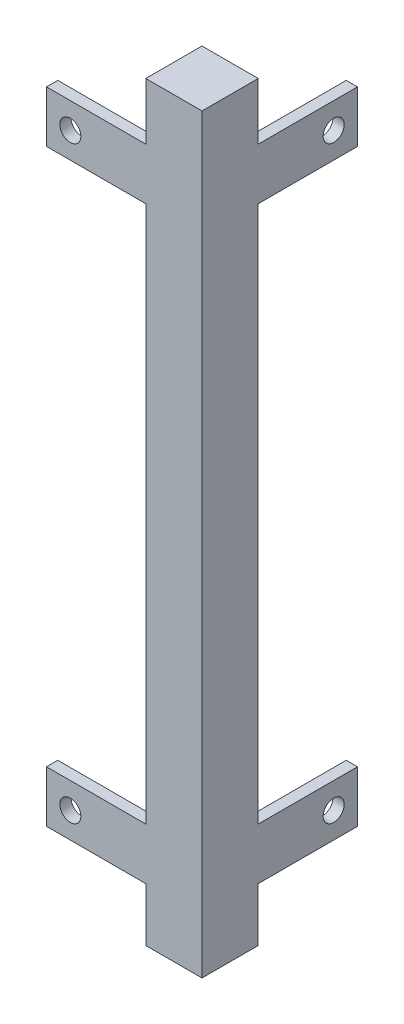
ISO-10303-21;
HEADER;
FILE_DESCRIPTION(('STEP AP214'),'2;1');
FILE_NAME('part.step','',(''),(''),'','','');
FILE_SCHEMA(('AUTOMOTIVE_DESIGN { 1 0 10303 214 1 1 1 1 }'));
ENDSEC;
DATA;
#1=APPLICATION_CONTEXT('core data for automotive mechanical design processes');
#2=APPLICATION_PROTOCOL_DEFINITION('international standard','automotive_design',2000,#1);
#3=PRODUCT_CONTEXT('',#1,'mechanical');
#4=PRODUCT('Part','Part','',(#3));
#5=PRODUCT_RELATED_PRODUCT_CATEGORY('part','',(#4));
#6=PRODUCT_DEFINITION_FORMATION('','',#4);
#7=PRODUCT_DEFINITION_CONTEXT('part definition',#1,'design');
#8=PRODUCT_DEFINITION('design','',#6,#7);
#9=PRODUCT_DEFINITION_SHAPE('','',#8);
#10=(LENGTH_UNIT() NAMED_UNIT(*) SI_UNIT(.MILLI.,.METRE.));
#11=(NAMED_UNIT(*) PLANE_ANGLE_UNIT() SI_UNIT($,.RADIAN.));
#12=(NAMED_UNIT(*) SI_UNIT($,.STERADIAN.) SOLID_ANGLE_UNIT());
#13=UNCERTAINTY_MEASURE_WITH_UNIT(LENGTH_MEASURE(1.E-05),#10,'distance_accuracy_value','');
#14=(GEOMETRIC_REPRESENTATION_CONTEXT(3) GLOBAL_UNCERTAINTY_ASSIGNED_CONTEXT((#13)) GLOBAL_UNIT_ASSIGNED_CONTEXT((#10,
#11,#12)) REPRESENTATION_CONTEXT('',''));
#15=CARTESIAN_POINT('',(0.,0.,0.));
#16=DIRECTION('',(0.,0.,1.));
#17=DIRECTION('',(1.,0.,0.));
#18=AXIS2_PLACEMENT_3D('',#15,#16,#17);
#19=CARTESIAN_POINT('',(50.000000000024,8.1,50.));
#20=DIRECTION('',(0.,0.,1.));
#21=DIRECTION('',(1.,0.,0.));
#22=AXIS2_PLACEMENT_3D('',#19,#20,#21);
#23=PLANE('',#22);
#24=CARTESIAN_POINT('',(30.095,101.,50.));
#25=DIRECTION('',(0.,0.,1.));
#26=DIRECTION('',(1.,0.,0.));
#27=AXIS2_PLACEMENT_3D('',#24,#25,#26);
#28=CIRCLE('',#27,1.59000000000001);
#29=CARTESIAN_POINT('',(31.685,101.,50.));
#30=VERTEX_POINT('',#29);
#31=EDGE_CURVE('E819',#30,#30,#28,.F.);
#32=ORIENTED_EDGE('',*,*,#31,.T.);
#33=EDGE_LOOP('',(#32));
#34=FACE_BOUND('',#33,.T.);
#35=DIRECTION('',(-1.,0.,0.));
#36=VECTOR('',#35,1.);
#37=CARTESIAN_POINT('',(50.000000000024,0.,50.));
#38=LINE('',#37,#36);
#39=CARTESIAN_POINT('',(50.000000000024,0.,50.));
#40=VERTEX_POINT('',#39);
#41=CARTESIAN_POINT('',(41.500000000024,0.,50.));
#42=VERTEX_POINT('',#41);
#43=EDGE_CURVE('E358',#40,#42,#38,.T.);
#44=ORIENTED_EDGE('',*,*,#43,.F.);
#45=DIRECTION('',(0.,-1.,0.));
#46=VECTOR('',#45,1.);
#47=CARTESIAN_POINT('',(50.000000000024,8.1,50.));
#48=LINE('',#47,#46);
#49=CARTESIAN_POINT('',(50.000000000024,113.5,50.));
#50=VERTEX_POINT('',#49);
#51=EDGE_CURVE('E361',#50,#40,#48,.T.);
#52=ORIENTED_EDGE('',*,*,#51,.F.);
#53=DIRECTION('',(1.,0.,0.));
#54=VECTOR('',#53,1.);
#55=CARTESIAN_POINT('',(0.,113.5,50.));
#56=LINE('',#55,#54);
#57=CARTESIAN_POINT('',(41.500000000024,113.5,50.));
#58=VERTEX_POINT('',#57);
#59=EDGE_CURVE('E320',#58,#50,#56,.T.);
#60=ORIENTED_EDGE('',*,*,#59,.F.);
#61=DIRECTION('',(0.,-1.,0.));
#62=VECTOR('',#61,1.);
#63=CARTESIAN_POINT('',(41.500000000024,8.1,50.));
#64=LINE('',#63,#62);
#65=CARTESIAN_POINT('',(41.500000000024,104.9,50.));
#66=VERTEX_POINT('',#65);
#67=EDGE_CURVE('E373',#58,#66,#64,.T.);
#68=ORIENTED_EDGE('',*,*,#67,.T.);
#69=DIRECTION('',(1.,0.,0.));
#70=VECTOR('',#69,1.);
#71=CARTESIAN_POINT('',(50.000000000024,104.9,50.));
#72=LINE('',#71,#70);
#73=CARTESIAN_POINT('',(26.500000000024,104.9,50.));
#74=VERTEX_POINT('',#73);
#75=EDGE_CURVE('E237',#74,#66,#72,.T.);
#76=ORIENTED_EDGE('',*,*,#75,.F.);
#77=DIRECTION('',(0.,1.,0.));
#78=VECTOR('',#77,1.);
#79=CARTESIAN_POINT('',(26.500000000024,8.1,50.));
#80=LINE('',#79,#78);
#81=CARTESIAN_POINT('',(26.500000000024,97.1,50.));
#82=VERTEX_POINT('',#81);
#83=EDGE_CURVE('E228',#82,#74,#80,.T.);
#84=ORIENTED_EDGE('',*,*,#83,.F.);
#85=DIRECTION('',(-1.,0.,0.));
#86=VECTOR('',#85,1.);
#87=CARTESIAN_POINT('',(50.000000000024,97.1,50.));
#88=LINE('',#87,#86);
#89=CARTESIAN_POINT('',(41.500000000024,97.1,50.));
#90=VERTEX_POINT('',#89);
#91=EDGE_CURVE('E233',#90,#82,#88,.T.);
#92=ORIENTED_EDGE('',*,*,#91,.F.);
#93=CARTESIAN_POINT('',(41.500000000024,15.9,50.));
#94=VERTEX_POINT('',#93);
#95=EDGE_CURVE('E377',#90,#94,#64,.T.);
#96=ORIENTED_EDGE('',*,*,#95,.T.);
#97=DIRECTION('',(-1.,0.,0.));
#98=VECTOR('',#97,1.);
#99=CARTESIAN_POINT('',(50.000000000024,15.9,50.));
#100=LINE('',#99,#98);
#101=CARTESIAN_POINT('',(26.500000000024,15.9,50.));
#102=VERTEX_POINT('',#101);
#103=EDGE_CURVE('E63',#94,#102,#100,.T.);
#104=ORIENTED_EDGE('',*,*,#103,.T.);
#105=DIRECTION('',(0.,-1.,0.));
#106=VECTOR('',#105,1.);
#107=CARTESIAN_POINT('',(26.500000000024,8.1,50.));
#108=LINE('',#107,#106);
#109=CARTESIAN_POINT('',(26.500000000024,8.09999999999999,50.));
#110=VERTEX_POINT('',#109);
#111=EDGE_CURVE('E204',#102,#110,#108,.T.);
#112=ORIENTED_EDGE('',*,*,#111,.T.);
#113=DIRECTION('',(1.,0.,0.));
#114=VECTOR('',#113,1.);
#115=CARTESIAN_POINT('',(50.000000000024,8.1,50.));
#116=LINE('',#115,#114);
#117=CARTESIAN_POINT('',(41.500000000024,8.1,50.));
#118=VERTEX_POINT('',#117);
#119=EDGE_CURVE('E55',#110,#118,#116,.T.);
#120=ORIENTED_EDGE('',*,*,#119,.T.);
#121=EDGE_CURVE('E372',#118,#42,#64,.T.);
#122=ORIENTED_EDGE('',*,*,#121,.T.);
#123=EDGE_LOOP('',(#44,#52,#60,#68,#76,#84,#92,#96,#104,#112,#120,#122));
#124=FACE_BOUND('',#123,.T.);
#125=CARTESIAN_POINT('',(30.095,12.,50.));
#126=DIRECTION('',(0.,0.,1.));
#127=DIRECTION('',(1.,0.,0.));
#128=AXIS2_PLACEMENT_3D('',#125,#126,#127);
#129=CIRCLE('',#128,1.59000000000001);
#130=CARTESIAN_POINT('',(31.685,12.,50.));
#131=VERTEX_POINT('',#130);
#132=EDGE_CURVE('E391',#131,#131,#129,.T.);
#133=ORIENTED_EDGE('',*,*,#132,.F.);
#134=EDGE_LOOP('',(#133));
#135=FACE_BOUND('',#134,.T.);
#136=ADVANCED_FACE('F37',(#34,#124,#135),#23,.T.);
#137=CARTESIAN_POINT('',(0.,125.520815280171,48.3));
#138=DIRECTION('',(0.,0.,-1.));
#139=DIRECTION('',(-1.,0.,0.));
#140=AXIS2_PLACEMENT_3D('',#137,#138,#139);
#141=PLANE('',#140);
#142=CARTESIAN_POINT('',(30.095,101.,48.3));
#143=DIRECTION('',(0.,0.,-1.));
#144=DIRECTION('',(-1.,0.,0.));
#145=AXIS2_PLACEMENT_3D('',#142,#143,#144);
#146=CIRCLE('',#145,1.59000000000001);
#147=CARTESIAN_POINT('',(28.505,101.,48.3));
#148=VERTEX_POINT('',#147);
#149=EDGE_CURVE('E394',#148,#148,#146,.T.);
#150=ORIENTED_EDGE('',*,*,#149,.F.);
#151=EDGE_LOOP('',(#150));
#152=FACE_BOUND('',#151,.T.);
#153=DIRECTION('',(0.,-1.,0.));
#154=VECTOR('',#153,1.);
#155=CARTESIAN_POINT('',(41.500000000024,125.520815280171,48.3));
#156=LINE('',#155,#154);
#157=CARTESIAN_POINT('',(41.500000000024,97.1,48.3));
#158=VERTEX_POINT('',#157);
#159=CARTESIAN_POINT('',(41.500000000024,15.9,48.3));
#160=VERTEX_POINT('',#159);
#161=EDGE_CURVE('E330',#158,#160,#156,.T.);
#162=ORIENTED_EDGE('',*,*,#161,.F.);
#163=DIRECTION('',(-1.,0.,0.));
#164=VECTOR('',#163,1.);
#165=CARTESIAN_POINT('',(50.000000000024,97.1,48.3));
#166=LINE('',#165,#164);
#167=CARTESIAN_POINT('',(26.500000000024,97.1,48.3));
#168=VERTEX_POINT('',#167);
#169=EDGE_CURVE('E240',#158,#168,#166,.T.);
#170=ORIENTED_EDGE('',*,*,#169,.T.);
#171=DIRECTION('',(0.,1.,0.));
#172=VECTOR('',#171,1.);
#173=CARTESIAN_POINT('',(26.500000000024,8.1,48.3));
#174=LINE('',#173,#172);
#175=CARTESIAN_POINT('',(26.500000000024,104.9,48.3));
#176=VERTEX_POINT('',#175);
#177=EDGE_CURVE('E231',#168,#176,#174,.T.);
#178=ORIENTED_EDGE('',*,*,#177,.T.);
#179=DIRECTION('',(1.,0.,0.));
#180=VECTOR('',#179,1.);
#181=CARTESIAN_POINT('',(50.000000000024,104.9,48.3));
#182=LINE('',#181,#180);
#183=CARTESIAN_POINT('',(41.500000000024,104.9,48.3));
#184=VERTEX_POINT('',#183);
#185=EDGE_CURVE('E244',#176,#184,#182,.T.);
#186=ORIENTED_EDGE('',*,*,#185,.T.);
#187=DIRECTION('',(1.,0.,0.));
#188=VECTOR('',#187,1.);
#189=CARTESIAN_POINT('',(0.,104.9,48.3));
#190=LINE('',#189,#188);
#191=CARTESIAN_POINT('',(46.2999999999755,104.9,48.3));
#192=VERTEX_POINT('',#191);
#193=EDGE_CURVE('E345',#184,#192,#190,.T.);
#194=ORIENTED_EDGE('',*,*,#193,.T.);
#195=DIRECTION('',(0.,-1.,0.));
#196=VECTOR('',#195,1.);
#197=CARTESIAN_POINT('',(46.2999999999755,125.520815280171,48.3));
#198=LINE('',#197,#196);
#199=CARTESIAN_POINT('',(46.2999999999755,8.1,48.3));
#200=VERTEX_POINT('',#199);
#201=EDGE_CURVE('E344',#192,#200,#198,.T.);
#202=ORIENTED_EDGE('',*,*,#201,.T.);
#203=DIRECTION('',(1.,0.,0.));
#204=VECTOR('',#203,1.);
#205=CARTESIAN_POINT('',(0.,8.1,48.3));
#206=LINE('',#205,#204);
#207=CARTESIAN_POINT('',(41.500000000024,8.1,48.3));
#208=VERTEX_POINT('',#207);
#209=EDGE_CURVE('E322',#208,#200,#206,.T.);
#210=ORIENTED_EDGE('',*,*,#209,.F.);
#211=DIRECTION('',(1.,0.,0.));
#212=VECTOR('',#211,1.);
#213=CARTESIAN_POINT('',(50.000000000024,8.1,48.3));
#214=LINE('',#213,#212);
#215=CARTESIAN_POINT('',(26.500000000024,8.09999999999999,48.3));
#216=VERTEX_POINT('',#215);
#217=EDGE_CURVE('E217',#216,#208,#214,.T.);
#218=ORIENTED_EDGE('',*,*,#217,.F.);
#219=DIRECTION('',(0.,-1.,0.));
#220=VECTOR('',#219,1.);
#221=CARTESIAN_POINT('',(26.500000000024,8.1,48.3));
#222=LINE('',#221,#220);
#223=CARTESIAN_POINT('',(26.500000000024,15.9,48.3));
#224=VERTEX_POINT('',#223);
#225=EDGE_CURVE('E202',#224,#216,#222,.T.);
#226=ORIENTED_EDGE('',*,*,#225,.F.);
#227=DIRECTION('',(-1.,0.,0.));
#228=VECTOR('',#227,1.);
#229=CARTESIAN_POINT('',(50.000000000024,15.9,48.3));
#230=LINE('',#229,#228);
#231=EDGE_CURVE('E205',#160,#224,#230,.T.);
#232=ORIENTED_EDGE('',*,*,#231,.F.);
#233=EDGE_LOOP('',(#162,#170,#178,#186,#194,#202,#210,#218,#226,#232));
#234=FACE_BOUND('',#233,.T.);
#235=CARTESIAN_POINT('',(30.095,12.,48.3));
#236=DIRECTION('',(0.,0.,-1.));
#237=DIRECTION('',(-1.,0.,0.));
#238=AXIS2_PLACEMENT_3D('',#235,#236,#237);
#239=CIRCLE('',#238,1.59000000000001);
#240=CARTESIAN_POINT('',(28.505,12.,48.3));
#241=VERTEX_POINT('',#240);
#242=EDGE_CURVE('E814',#241,#241,#239,.F.);
#243=ORIENTED_EDGE('',*,*,#242,.T.);
#244=EDGE_LOOP('',(#243));
#245=FACE_BOUND('',#244,.T.);
#246=ADVANCED_FACE('F214',(#152,#234,#245),#141,.T.);
#247=CARTESIAN_POINT('',(50.000000000024,8.1,50.));
#248=DIRECTION('',(-1.,0.,0.));
#249=DIRECTION('',(0.,0.,1.));
#250=AXIS2_PLACEMENT_3D('',#247,#248,#249);
#251=PLANE('',#250);
#252=DIRECTION('',(0.,0.,-1.));
#253=VECTOR('',#252,1.);
#254=CARTESIAN_POINT('',(50.000000000024,0.,50.));
#255=LINE('',#254,#253);
#256=CARTESIAN_POINT('',(50.000000000024,0.,41.5));
#257=VERTEX_POINT('',#256);
#258=EDGE_CURVE('E350',#40,#257,#255,.T.);
#259=ORIENTED_EDGE('',*,*,#258,.T.);
#260=DIRECTION('',(0.,-1.,0.));
#261=VECTOR('',#260,1.);
#262=CARTESIAN_POINT('',(50.000000000024,8.1,41.5));
#263=LINE('',#262,#261);
#264=CARTESIAN_POINT('',(50.000000000024,8.10000000000001,41.5));
#265=VERTEX_POINT('',#264);
#266=EDGE_CURVE('E48',#265,#257,#263,.T.);
#267=ORIENTED_EDGE('',*,*,#266,.F.);
#268=DIRECTION('',(0.,0.,1.));
#269=VECTOR('',#268,1.);
#270=CARTESIAN_POINT('',(50.000000000024,8.1,0.));
#271=LINE('',#270,#269);
#272=CARTESIAN_POINT('',(50.000000000024,8.1,26.5));
#273=VERTEX_POINT('',#272);
#274=EDGE_CURVE('E290',#273,#265,#271,.T.);
#275=ORIENTED_EDGE('',*,*,#274,.F.);
#276=DIRECTION('',(0.,-1.,0.));
#277=VECTOR('',#276,1.);
#278=CARTESIAN_POINT('',(50.000000000024,0.,26.5));
#279=LINE('',#278,#277);
#280=CARTESIAN_POINT('',(50.000000000024,15.9,26.5));
#281=VERTEX_POINT('',#280);
#282=EDGE_CURVE('E286',#281,#273,#279,.T.);
#283=ORIENTED_EDGE('',*,*,#282,.F.);
#284=DIRECTION('',(0.,0.,-1.));
#285=VECTOR('',#284,1.);
#286=CARTESIAN_POINT('',(50.000000000024,15.9,0.));
#287=LINE('',#286,#285);
#288=CARTESIAN_POINT('',(50.000000000024,15.9,41.5));
#289=VERTEX_POINT('',#288);
#290=EDGE_CURVE('E281',#289,#281,#287,.T.);
#291=ORIENTED_EDGE('',*,*,#290,.F.);
#292=CARTESIAN_POINT('',(50.000000000024,97.1,41.5));
#293=VERTEX_POINT('',#292);
#294=EDGE_CURVE('E46',#293,#289,#263,.T.);
#295=ORIENTED_EDGE('',*,*,#294,.F.);
#296=DIRECTION('',(0.,0.,1.));
#297=VECTOR('',#296,1.);
#298=CARTESIAN_POINT('',(50.000000000024,97.1,0.));
#299=LINE('',#298,#297);
#300=CARTESIAN_POINT('',(50.000000000024,97.1,26.5));
#301=VERTEX_POINT('',#300);
#302=EDGE_CURVE('E264',#301,#293,#299,.T.);
#303=ORIENTED_EDGE('',*,*,#302,.F.);
#304=DIRECTION('',(0.,-1.,0.));
#305=VECTOR('',#304,1.);
#306=CARTESIAN_POINT('',(50.000000000024,0.,26.5));
#307=LINE('',#306,#305);
#308=CARTESIAN_POINT('',(50.000000000024,104.9,26.5));
#309=VERTEX_POINT('',#308);
#310=EDGE_CURVE('E260',#309,#301,#307,.T.);
#311=ORIENTED_EDGE('',*,*,#310,.F.);
#312=DIRECTION('',(0.,0.,-1.));
#313=VECTOR('',#312,1.);
#314=CARTESIAN_POINT('',(50.000000000024,104.9,0.));
#315=LINE('',#314,#313);
#316=CARTESIAN_POINT('',(50.000000000024,104.9,41.5));
#317=VERTEX_POINT('',#316);
#318=EDGE_CURVE('E255',#317,#309,#315,.T.);
#319=ORIENTED_EDGE('',*,*,#318,.F.);
#320=CARTESIAN_POINT('',(50.000000000024,113.5,41.5));
#321=VERTEX_POINT('',#320);
#322=EDGE_CURVE('E11',#321,#317,#263,.T.);
#323=ORIENTED_EDGE('',*,*,#322,.F.);
#324=DIRECTION('',(0.,0.,1.));
#325=VECTOR('',#324,1.);
#326=CARTESIAN_POINT('',(50.000000000024,113.5,0.));
#327=LINE('',#326,#325);
#328=EDGE_CURVE('E297',#321,#50,#327,.T.);
#329=ORIENTED_EDGE('',*,*,#328,.T.);
#330=ORIENTED_EDGE('',*,*,#51,.T.);
#331=EDGE_LOOP('',(#259,#267,#275,#283,#291,#295,#303,#311,#319,#323,#329,#330));
#332=FACE_BOUND('',#331,.T.);
#333=CARTESIAN_POINT('',(50.000000000024,12.,30.094999999976));
#334=DIRECTION('',(-1.,0.,0.));
#335=DIRECTION('',(0.,0.,1.));
#336=AXIS2_PLACEMENT_3D('',#333,#334,#335);
#337=CIRCLE('',#336,1.59000000000001);
#338=CARTESIAN_POINT('',(50.000000000024,12.,31.684999999976));
#339=VERTEX_POINT('',#338);
#340=EDGE_CURVE('E386',#339,#339,#337,.F.);
#341=ORIENTED_EDGE('',*,*,#340,.F.);
#342=EDGE_LOOP('',(#341));
#343=FACE_BOUND('',#342,.T.);
#344=CARTESIAN_POINT('',(50.000000000024,101.,30.094999999976));
#345=DIRECTION('',(-1.,0.,0.));
#346=DIRECTION('',(0.,0.,1.));
#347=AXIS2_PLACEMENT_3D('',#344,#345,#346);
#348=CIRCLE('',#347,1.59000000000002);
#349=CARTESIAN_POINT('',(50.000000000024,101.,31.684999999976));
#350=VERTEX_POINT('',#349);
#351=EDGE_CURVE('E381',#350,#350,#348,.T.);
#352=ORIENTED_EDGE('',*,*,#351,.T.);
#353=EDGE_LOOP('',(#352));
#354=FACE_BOUND('',#353,.T.);
#355=ADVANCED_FACE('F39',(#332,#343,#354),#251,.F.);
#356=CARTESIAN_POINT('',(48.2999999999756,125.520815280171,0.));
#357=DIRECTION('',(-1.,0.,0.));
#358=DIRECTION('',(0.,0.,1.));
#359=AXIS2_PLACEMENT_3D('',#356,#357,#358);
#360=PLANE('',#359);
#361=CARTESIAN_POINT('',(48.2999999999755,12.,30.094999999976));
#362=DIRECTION('',(-1.,0.,0.));
#363=DIRECTION('',(0.,0.,1.));
#364=AXIS2_PLACEMENT_3D('',#361,#362,#363);
#365=CIRCLE('',#364,1.59000000000001);
#366=CARTESIAN_POINT('',(48.2999999999755,12.,31.684999999976));
#367=VERTEX_POINT('',#366);
#368=EDGE_CURVE('E379',#367,#367,#365,.F.);
#369=ORIENTED_EDGE('',*,*,#368,.T.);
#370=EDGE_LOOP('',(#369));
#371=FACE_BOUND('',#370,.T.);
#372=DIRECTION('',(0.,-1.,0.));
#373=VECTOR('',#372,1.);
#374=CARTESIAN_POINT('',(48.2999999999755,125.520815280171,46.3));
#375=LINE('',#374,#373);
#376=CARTESIAN_POINT('',(48.2999999999755,104.9,46.3));
#377=VERTEX_POINT('',#376);
#378=CARTESIAN_POINT('',(48.2999999999755,8.1,46.3));
#379=VERTEX_POINT('',#378);
#380=EDGE_CURVE('E340',#377,#379,#375,.T.);
#381=ORIENTED_EDGE('',*,*,#380,.F.);
#382=DIRECTION('',(0.,0.,-1.));
#383=VECTOR('',#382,1.);
#384=CARTESIAN_POINT('',(48.2999999999756,104.9,0.));
#385=LINE('',#384,#383);
#386=CARTESIAN_POINT('',(48.2999999999755,104.9,41.5));
#387=VERTEX_POINT('',#386);
#388=EDGE_CURVE('E336',#377,#387,#385,.T.);
#389=ORIENTED_EDGE('',*,*,#388,.T.);
#390=DIRECTION('',(0.,0.,-1.));
#391=VECTOR('',#390,1.);
#392=CARTESIAN_POINT('',(48.2999999999756,104.9,0.));
#393=LINE('',#392,#391);
#394=CARTESIAN_POINT('',(48.2999999999755,104.9,26.5));
#395=VERTEX_POINT('',#394);
#396=EDGE_CURVE('E267',#387,#395,#393,.T.);
#397=ORIENTED_EDGE('',*,*,#396,.T.);
#398=DIRECTION('',(0.,-1.,0.));
#399=VECTOR('',#398,1.);
#400=CARTESIAN_POINT('',(48.2999999999755,0.,26.5));
#401=LINE('',#400,#399);
#402=CARTESIAN_POINT('',(48.2999999999755,97.1,26.5));
#403=VERTEX_POINT('',#402);
#404=EDGE_CURVE('E263',#395,#403,#401,.T.);
#405=ORIENTED_EDGE('',*,*,#404,.T.);
#406=DIRECTION('',(0.,0.,1.));
#407=VECTOR('',#406,1.);
#408=CARTESIAN_POINT('',(48.2999999999756,97.1,0.));
#409=LINE('',#408,#407);
#410=CARTESIAN_POINT('',(48.2999999999755,97.1,41.5));
#411=VERTEX_POINT('',#410);
#412=EDGE_CURVE('E271',#403,#411,#409,.T.);
#413=ORIENTED_EDGE('',*,*,#412,.T.);
#414=DIRECTION('',(0.,-1.,0.));
#415=VECTOR('',#414,1.);
#416=CARTESIAN_POINT('',(48.2999999999755,125.520815280171,41.5));
#417=LINE('',#416,#415);
#418=CARTESIAN_POINT('',(48.2999999999755,15.9,41.5));
#419=VERTEX_POINT('',#418);
#420=EDGE_CURVE('E339',#411,#419,#417,.T.);
#421=ORIENTED_EDGE('',*,*,#420,.T.);
#422=DIRECTION('',(0.,0.,-1.));
#423=VECTOR('',#422,1.);
#424=CARTESIAN_POINT('',(48.2999999999756,15.9,0.));
#425=LINE('',#424,#423);
#426=CARTESIAN_POINT('',(48.2999999999755,15.9,26.5));
#427=VERTEX_POINT('',#426);
#428=EDGE_CURVE('E294',#419,#427,#425,.T.);
#429=ORIENTED_EDGE('',*,*,#428,.T.);
#430=DIRECTION('',(0.,-1.,0.));
#431=VECTOR('',#430,1.);
#432=CARTESIAN_POINT('',(48.2999999999755,0.,26.5));
#433=LINE('',#432,#431);
#434=CARTESIAN_POINT('',(48.2999999999755,8.1,26.5));
#435=VERTEX_POINT('',#434);
#436=EDGE_CURVE('E289',#427,#435,#433,.T.);
#437=ORIENTED_EDGE('',*,*,#436,.T.);
#438=DIRECTION('',(0.,0.,1.));
#439=VECTOR('',#438,1.);
#440=CARTESIAN_POINT('',(48.2999999999756,8.1,0.));
#441=LINE('',#440,#439);
#442=CARTESIAN_POINT('',(48.2999999999755,8.1,41.5));
#443=VERTEX_POINT('',#442);
#444=EDGE_CURVE('E298',#435,#443,#441,.T.);
#445=ORIENTED_EDGE('',*,*,#444,.T.);
#446=DIRECTION('',(0.,0.,-1.));
#447=VECTOR('',#446,1.);
#448=CARTESIAN_POINT('',(48.2999999999756,8.1,0.));
#449=LINE('',#448,#447);
#450=EDGE_CURVE('E327',#379,#443,#449,.T.);
#451=ORIENTED_EDGE('',*,*,#450,.F.);
#452=EDGE_LOOP('',(#381,#389,#397,#405,#413,#421,#429,#437,#445,#451));
#453=FACE_BOUND('',#452,.T.);
#454=CARTESIAN_POINT('',(48.2999999999755,101.,30.094999999976));
#455=DIRECTION('',(-1.,0.,0.));
#456=DIRECTION('',(0.,0.,1.));
#457=AXIS2_PLACEMENT_3D('',#454,#455,#456);
#458=CIRCLE('',#457,1.59000000000002);
#459=CARTESIAN_POINT('',(48.2999999999755,101.,31.684999999976));
#460=VERTEX_POINT('',#459);
#461=EDGE_CURVE('E41',#460,#460,#458,.T.);
#462=ORIENTED_EDGE('',*,*,#461,.F.);
#463=EDGE_LOOP('',(#462));
#464=FACE_BOUND('',#463,.T.);
#465=ADVANCED_FACE('F482',(#371,#453,#464),#360,.T.);
#466=CARTESIAN_POINT('',(41.500000000024,8.1,50.));
#467=DIRECTION('',(-1.,0.,0.));
#468=DIRECTION('',(0.,0.,1.));
#469=AXIS2_PLACEMENT_3D('',#466,#467,#468);
#470=PLANE('',#469);
#471=DIRECTION('',(0.,0.,1.));
#472=VECTOR('',#471,1.);
#473=CARTESIAN_POINT('',(41.500000000024,15.9,31.3931966356736));
#474=LINE('',#473,#472);
#475=EDGE_CURVE('E209',#160,#94,#474,.T.);
#476=ORIENTED_EDGE('',*,*,#475,.T.);
#477=ORIENTED_EDGE('',*,*,#95,.F.);
#478=DIRECTION('',(0.,0.,1.));
#479=VECTOR('',#478,1.);
#480=CARTESIAN_POINT('',(41.500000000024,97.1,31.3931966356736));
#481=LINE('',#480,#479);
#482=EDGE_CURVE('E236',#158,#90,#481,.T.);
#483=ORIENTED_EDGE('',*,*,#482,.F.);
#484=ORIENTED_EDGE('',*,*,#161,.T.);
#485=EDGE_LOOP('',(#476,#477,#483,#484));
#486=FACE_BOUND('',#485,.T.);
#487=ADVANCED_FACE('F404',(#486),#470,.T.);
#488=DIRECTION('',(0.,0.,1.));
#489=VECTOR('',#488,1.);
#490=CARTESIAN_POINT('',(41.500000000024,104.9,0.));
#491=LINE('',#490,#489);
#492=CARTESIAN_POINT('',(41.500000000024,104.9,41.5));
#493=VERTEX_POINT('',#492);
#494=EDGE_CURVE('E307',#493,#184,#491,.T.);
#495=ORIENTED_EDGE('',*,*,#494,.T.);
#496=DIRECTION('',(0.,0.,1.));
#497=VECTOR('',#496,1.);
#498=CARTESIAN_POINT('',(41.500000000024,104.9,31.3931966356736));
#499=LINE('',#498,#497);
#500=EDGE_CURVE('E239',#184,#66,#499,.T.);
#501=ORIENTED_EDGE('',*,*,#500,.T.);
#502=ORIENTED_EDGE('',*,*,#67,.F.);
#503=DIRECTION('',(0.,0.,1.));
#504=VECTOR('',#503,1.);
#505=CARTESIAN_POINT('',(41.500000000024,113.5,0.));
#506=LINE('',#505,#504);
#507=CARTESIAN_POINT('',(41.500000000024,113.5,41.5));
#508=VERTEX_POINT('',#507);
#509=EDGE_CURVE('E314',#508,#58,#506,.T.);
#510=ORIENTED_EDGE('',*,*,#509,.F.);
#511=DIRECTION('',(0.,-1.,0.));
#512=VECTOR('',#511,1.);
#513=CARTESIAN_POINT('',(41.500000000024,125.520815280171,41.5));
#514=LINE('',#513,#512);
#515=EDGE_CURVE('E311',#508,#493,#514,.T.);
#516=ORIENTED_EDGE('',*,*,#515,.T.);
#517=EDGE_LOOP('',(#495,#501,#502,#510,#516));
#518=FACE_BOUND('',#517,.T.);
#519=ADVANCED_FACE('F460',(#518),#470,.T.);
#520=CARTESIAN_POINT('',(50.000000000024,8.1,41.5));
#521=DIRECTION('',(0.,0.,1.));
#522=DIRECTION('',(1.,0.,0.));
#523=AXIS2_PLACEMENT_3D('',#520,#521,#522);
#524=PLANE('',#523);
#525=DIRECTION('',(1.,0.,0.));
#526=VECTOR('',#525,1.);
#527=CARTESIAN_POINT('',(31.3931966356491,97.1,41.5));
#528=LINE('',#527,#526);
#529=EDGE_CURVE('E266',#411,#293,#528,.T.);
#530=ORIENTED_EDGE('',*,*,#529,.T.);
#531=ORIENTED_EDGE('',*,*,#294,.T.);
#532=DIRECTION('',(1.,0.,0.));
#533=VECTOR('',#532,1.);
#534=CARTESIAN_POINT('',(31.3931966356491,15.9,41.5));
#535=LINE('',#534,#533);
#536=EDGE_CURVE('E285',#419,#289,#535,.T.);
#537=ORIENTED_EDGE('',*,*,#536,.F.);
#538=ORIENTED_EDGE('',*,*,#420,.F.);
#539=EDGE_LOOP('',(#530,#531,#537,#538));
#540=FACE_BOUND('',#539,.T.);
#541=ADVANCED_FACE('F463',(#540),#524,.F.);
#542=DIRECTION('',(1.,0.,0.));
#543=VECTOR('',#542,1.);
#544=CARTESIAN_POINT('',(31.3931966356491,104.9,41.5));
#545=LINE('',#544,#543);
#546=EDGE_CURVE('E259',#387,#317,#545,.T.);
#547=ORIENTED_EDGE('',*,*,#546,.F.);
#548=DIRECTION('',(1.,0.,0.));
#549=VECTOR('',#548,1.);
#550=CARTESIAN_POINT('',(0.,104.9,41.5));
#551=LINE('',#550,#549);
#552=EDGE_CURVE('E310',#493,#387,#551,.T.);
#553=ORIENTED_EDGE('',*,*,#552,.F.);
#554=ORIENTED_EDGE('',*,*,#515,.F.);
#555=DIRECTION('',(1.,0.,0.));
#556=VECTOR('',#555,1.);
#557=CARTESIAN_POINT('',(0.,113.5,41.5));
#558=LINE('',#557,#556);
#559=EDGE_CURVE('E315',#508,#321,#558,.T.);
#560=ORIENTED_EDGE('',*,*,#559,.T.);
#561=ORIENTED_EDGE('',*,*,#322,.T.);
#562=EDGE_LOOP('',(#547,#553,#554,#560,#561));
#563=FACE_BOUND('',#562,.T.);
#564=ADVANCED_FACE('F464',(#563),#524,.F.);
#565=CARTESIAN_POINT('',(0.,8.1,0.));
#566=DIRECTION('',(0.,1.,0.));
#567=DIRECTION('',(0.,0.,-1.));
#568=AXIS2_PLACEMENT_3D('',#565,#566,#567);
#569=PLANE('',#568);
#570=DIRECTION('',(0.,0.,-1.));
#571=VECTOR('',#570,1.);
#572=CARTESIAN_POINT('',(41.500000000024,8.1,50.));
#573=LINE('',#572,#571);
#574=CARTESIAN_POINT('',(41.500000000024,8.1,41.5));
#575=VERTEX_POINT('',#574);
#576=EDGE_CURVE('E357',#208,#575,#573,.T.);
#577=ORIENTED_EDGE('',*,*,#576,.F.);
#578=ORIENTED_EDGE('',*,*,#209,.T.);
#579=CARTESIAN_POINT('',(46.2999999999755,8.1,46.3));
#580=DIRECTION('',(0.,1.,0.));
#581=DIRECTION('',(0.,0.,-1.));
#582=AXIS2_PLACEMENT_3D('',#579,#580,#581);
#583=CIRCLE('',#582,2.);
#584=EDGE_CURVE('E331',#200,#379,#583,.T.);
#585=ORIENTED_EDGE('',*,*,#584,.T.);
#586=ORIENTED_EDGE('',*,*,#450,.T.);
#587=DIRECTION('',(-1.,0.,0.));
#588=VECTOR('',#587,1.);
#589=CARTESIAN_POINT('',(50.000000000024,8.1,41.5));
#590=LINE('',#589,#588);
#591=EDGE_CURVE('E354',#443,#575,#590,.T.);
#592=ORIENTED_EDGE('',*,*,#591,.T.);
#593=EDGE_LOOP('',(#577,#578,#585,#586,#592));
#594=FACE_BOUND('',#593,.T.);
#595=ADVANCED_FACE('F426',(#594),#569,.T.);
#596=ORIENTED_EDGE('',*,*,#591,.F.);
#597=DIRECTION('',(1.,0.,0.));
#598=VECTOR('',#597,1.);
#599=CARTESIAN_POINT('',(31.3931966356491,8.10000000000001,41.5));
#600=LINE('',#599,#598);
#601=EDGE_CURVE('E293',#443,#265,#600,.T.);
#602=ORIENTED_EDGE('',*,*,#601,.T.);
#603=ORIENTED_EDGE('',*,*,#266,.T.);
#604=DIRECTION('',(-1.,0.,0.));
#605=VECTOR('',#604,1.);
#606=CARTESIAN_POINT('',(50.000000000024,0.,41.5));
#607=LINE('',#606,#605);
#608=CARTESIAN_POINT('',(41.500000000024,0.,41.5));
#609=VERTEX_POINT('',#608);
#610=EDGE_CURVE('E364',#257,#609,#607,.T.);
#611=ORIENTED_EDGE('',*,*,#610,.T.);
#612=DIRECTION('',(0.,-1.,0.));
#613=VECTOR('',#612,1.);
#614=CARTESIAN_POINT('',(41.500000000024,8.1,41.5));
#615=LINE('',#614,#613);
#616=EDGE_CURVE('E376',#575,#609,#615,.T.);
#617=ORIENTED_EDGE('',*,*,#616,.F.);
#618=EDGE_LOOP('',(#596,#602,#603,#611,#617));
#619=FACE_BOUND('',#618,.T.);
#620=ADVANCED_FACE('F459',(#619),#524,.F.);
#621=DIRECTION('',(0.,0.,1.));
#622=VECTOR('',#621,1.);
#623=CARTESIAN_POINT('',(41.500000000024,8.1,31.3931966356736));
#624=LINE('',#623,#622);
#625=EDGE_CURVE('E223',#208,#118,#624,.T.);
#626=ORIENTED_EDGE('',*,*,#625,.F.);
#627=ORIENTED_EDGE('',*,*,#576,.T.);
#628=ORIENTED_EDGE('',*,*,#616,.T.);
#629=DIRECTION('',(0.,0.,-1.));
#630=VECTOR('',#629,1.);
#631=CARTESIAN_POINT('',(41.500000000024,0.,50.));
#632=LINE('',#631,#630);
#633=EDGE_CURVE('E367',#42,#609,#632,.T.);
#634=ORIENTED_EDGE('',*,*,#633,.F.);
#635=ORIENTED_EDGE('',*,*,#121,.F.);
#636=EDGE_LOOP('',(#626,#627,#628,#634,#635));
#637=FACE_BOUND('',#636,.T.);
#638=ADVANCED_FACE('F430',(#637),#470,.T.);
#639=CARTESIAN_POINT('',(0.,0.,0.));
#640=DIRECTION('',(0.,1.,0.));
#641=DIRECTION('',(0.,0.,-1.));
#642=AXIS2_PLACEMENT_3D('',#639,#640,#641);
#643=PLANE('',#642);
#644=ORIENTED_EDGE('',*,*,#258,.F.);
#645=ORIENTED_EDGE('',*,*,#43,.T.);
#646=ORIENTED_EDGE('',*,*,#633,.T.);
#647=ORIENTED_EDGE('',*,*,#610,.F.);
#648=EDGE_LOOP('',(#644,#645,#646,#647));
#649=FACE_BOUND('',#648,.T.);
#650=ADVANCED_FACE('F456',(#649),#643,.F.);
#651=CARTESIAN_POINT('',(46.2999999999755,125.520815280171,46.3));
#652=DIRECTION('',(0.,-1.,0.));
#653=DIRECTION('',(0.,0.,1.));
#654=AXIS2_PLACEMENT_3D('',#651,#652,#653);
#655=CYLINDRICAL_SURFACE('',#654,2.);
#656=ORIENTED_EDGE('',*,*,#201,.F.);
#657=CARTESIAN_POINT('',(46.2999999999755,104.9,46.3));
#658=DIRECTION('',(0.,1.,0.));
#659=DIRECTION('',(0.,0.,-1.));
#660=AXIS2_PLACEMENT_3D('',#657,#658,#659);
#661=CIRCLE('',#660,2.);
#662=EDGE_CURVE('E341',#192,#377,#661,.T.);
#663=ORIENTED_EDGE('',*,*,#662,.T.);
#664=ORIENTED_EDGE('',*,*,#380,.T.);
#665=ORIENTED_EDGE('',*,*,#584,.F.);
#666=EDGE_LOOP('',(#656,#663,#664,#665));
#667=FACE_BOUND('',#666,.T.);
#668=ADVANCED_FACE('F422',(#667),#655,.F.);
#669=CARTESIAN_POINT('',(0.,104.9,0.));
#670=DIRECTION('',(0.,-1.,0.));
#671=DIRECTION('',(0.,0.,1.));
#672=AXIS2_PLACEMENT_3D('',#669,#670,#671);
#673=PLANE('',#672);
#674=ORIENTED_EDGE('',*,*,#388,.F.);
#675=ORIENTED_EDGE('',*,*,#662,.F.);
#676=ORIENTED_EDGE('',*,*,#193,.F.);
#677=ORIENTED_EDGE('',*,*,#494,.F.);
#678=ORIENTED_EDGE('',*,*,#552,.T.);
#679=EDGE_LOOP('',(#674,#675,#676,#677,#678));
#680=FACE_BOUND('',#679,.T.);
#681=ADVANCED_FACE('F419',(#680),#673,.T.);
#682=CARTESIAN_POINT('',(0.,113.5,0.));
#683=DIRECTION('',(0.,1.,0.));
#684=DIRECTION('',(0.,0.,-1.));
#685=AXIS2_PLACEMENT_3D('',#682,#683,#684);
#686=PLANE('',#685);
#687=ORIENTED_EDGE('',*,*,#509,.T.);
#688=ORIENTED_EDGE('',*,*,#59,.T.);
#689=ORIENTED_EDGE('',*,*,#328,.F.);
#690=ORIENTED_EDGE('',*,*,#559,.F.);
#691=EDGE_LOOP('',(#687,#688,#689,#690));
#692=FACE_BOUND('',#691,.T.);
#693=ADVANCED_FACE('F498',(#692),#686,.T.);
#694=CARTESIAN_POINT('',(31.3931966356491,8.1,0.));
#695=DIRECTION('',(0.,1.,0.));
#696=DIRECTION('',(0.,0.,-1.));
#697=AXIS2_PLACEMENT_3D('',#694,#695,#696);
#698=PLANE('',#697);
#699=ORIENTED_EDGE('',*,*,#444,.F.);
#700=DIRECTION('',(1.,0.,0.));
#701=VECTOR('',#700,1.);
#702=CARTESIAN_POINT('',(31.3931966356491,8.1,26.5));
#703=LINE('',#702,#701);
#704=EDGE_CURVE('E270',#435,#273,#703,.T.);
#705=ORIENTED_EDGE('',*,*,#704,.T.);
#706=ORIENTED_EDGE('',*,*,#274,.T.);
#707=ORIENTED_EDGE('',*,*,#601,.F.);
#708=EDGE_LOOP('',(#699,#705,#706,#707));
#709=FACE_BOUND('',#708,.T.);
#710=ADVANCED_FACE('F488',(#709),#698,.F.);
#711=CARTESIAN_POINT('',(31.3931966356491,15.9,0.));
#712=DIRECTION('',(0.,-1.,0.));
#713=DIRECTION('',(0.,0.,1.));
#714=AXIS2_PLACEMENT_3D('',#711,#712,#713);
#715=PLANE('',#714);
#716=ORIENTED_EDGE('',*,*,#428,.F.);
#717=ORIENTED_EDGE('',*,*,#536,.T.);
#718=ORIENTED_EDGE('',*,*,#290,.T.);
#719=DIRECTION('',(1.,0.,0.));
#720=VECTOR('',#719,1.);
#721=CARTESIAN_POINT('',(31.3931966356491,15.9,26.5));
#722=LINE('',#721,#720);
#723=EDGE_CURVE('E284',#427,#281,#722,.T.);
#724=ORIENTED_EDGE('',*,*,#723,.F.);
#725=EDGE_LOOP('',(#716,#717,#718,#724));
#726=FACE_BOUND('',#725,.T.);
#727=ADVANCED_FACE('F654',(#726),#715,.F.);
#728=CARTESIAN_POINT('',(31.3931966356491,0.,26.5));
#729=DIRECTION('',(0.,0.,1.));
#730=DIRECTION('',(1.,0.,0.));
#731=AXIS2_PLACEMENT_3D('',#728,#729,#730);
#732=PLANE('',#731);
#733=ORIENTED_EDGE('',*,*,#436,.F.);
#734=ORIENTED_EDGE('',*,*,#723,.T.);
#735=ORIENTED_EDGE('',*,*,#282,.T.);
#736=ORIENTED_EDGE('',*,*,#704,.F.);
#737=EDGE_LOOP('',(#733,#734,#735,#736));
#738=FACE_BOUND('',#737,.T.);
#739=ADVANCED_FACE('F736',(#738),#732,.F.);
#740=CARTESIAN_POINT('',(31.3931966356491,97.1,0.));
#741=DIRECTION('',(0.,1.,0.));
#742=DIRECTION('',(0.,0.,-1.));
#743=AXIS2_PLACEMENT_3D('',#740,#741,#742);
#744=PLANE('',#743);
#745=ORIENTED_EDGE('',*,*,#412,.F.);
#746=DIRECTION('',(1.,0.,0.));
#747=VECTOR('',#746,1.);
#748=CARTESIAN_POINT('',(31.3931966356491,97.1,26.5));
#749=LINE('',#748,#747);
#750=EDGE_CURVE('E243',#403,#301,#749,.T.);
#751=ORIENTED_EDGE('',*,*,#750,.T.);
#752=ORIENTED_EDGE('',*,*,#302,.T.);
#753=ORIENTED_EDGE('',*,*,#529,.F.);
#754=EDGE_LOOP('',(#745,#751,#752,#753));
#755=FACE_BOUND('',#754,.T.);
#756=ADVANCED_FACE('F664',(#755),#744,.F.);
#757=CARTESIAN_POINT('',(31.3931966356491,104.9,0.));
#758=DIRECTION('',(0.,-1.,0.));
#759=DIRECTION('',(0.,0.,1.));
#760=AXIS2_PLACEMENT_3D('',#757,#758,#759);
#761=PLANE('',#760);
#762=ORIENTED_EDGE('',*,*,#396,.F.);
#763=ORIENTED_EDGE('',*,*,#546,.T.);
#764=ORIENTED_EDGE('',*,*,#318,.T.);
#765=DIRECTION('',(1.,0.,0.));
#766=VECTOR('',#765,1.);
#767=CARTESIAN_POINT('',(31.3931966356491,104.9,26.5));
#768=LINE('',#767,#766);
#769=EDGE_CURVE('E258',#395,#309,#768,.T.);
#770=ORIENTED_EDGE('',*,*,#769,.F.);
#771=EDGE_LOOP('',(#762,#763,#764,#770));
#772=FACE_BOUND('',#771,.T.);
#773=ADVANCED_FACE('F478',(#772),#761,.F.);
#774=CARTESIAN_POINT('',(31.3931966356491,0.,26.5));
#775=DIRECTION('',(0.,0.,1.));
#776=DIRECTION('',(1.,0.,0.));
#777=AXIS2_PLACEMENT_3D('',#774,#775,#776);
#778=PLANE('',#777);
#779=ORIENTED_EDGE('',*,*,#404,.F.);
#780=ORIENTED_EDGE('',*,*,#769,.T.);
#781=ORIENTED_EDGE('',*,*,#310,.T.);
#782=ORIENTED_EDGE('',*,*,#750,.F.);
#783=EDGE_LOOP('',(#779,#780,#781,#782));
#784=FACE_BOUND('',#783,.T.);
#785=ADVANCED_FACE('F663',(#784),#778,.F.);
#786=CARTESIAN_POINT('',(50.000000000024,104.9,31.3931966356736));
#787=DIRECTION('',(0.,-1.,0.));
#788=DIRECTION('',(0.,0.,1.));
#789=AXIS2_PLACEMENT_3D('',#786,#787,#788);
#790=PLANE('',#789);
#791=ORIENTED_EDGE('',*,*,#185,.F.);
#792=DIRECTION('',(0.,0.,1.));
#793=VECTOR('',#792,1.);
#794=CARTESIAN_POINT('',(26.500000000024,104.9,31.3931966356736));
#795=LINE('',#794,#793);
#796=EDGE_CURVE('E227',#176,#74,#795,.T.);
#797=ORIENTED_EDGE('',*,*,#796,.T.);
#798=ORIENTED_EDGE('',*,*,#75,.T.);
#799=ORIENTED_EDGE('',*,*,#500,.F.);
#800=EDGE_LOOP('',(#791,#797,#798,#799));
#801=FACE_BOUND('',#800,.T.);
#802=ADVANCED_FACE('F414',(#801),#790,.F.);
#803=CARTESIAN_POINT('',(50.000000000024,97.1,31.3931966356736));
#804=DIRECTION('',(0.,1.,0.));
#805=DIRECTION('',(0.,0.,-1.));
#806=AXIS2_PLACEMENT_3D('',#803,#804,#805);
#807=PLANE('',#806);
#808=ORIENTED_EDGE('',*,*,#169,.F.);
#809=ORIENTED_EDGE('',*,*,#482,.T.);
#810=ORIENTED_EDGE('',*,*,#91,.T.);
#811=DIRECTION('',(0.,0.,1.));
#812=VECTOR('',#811,1.);
#813=CARTESIAN_POINT('',(26.500000000024,97.1,31.3931966356736));
#814=LINE('',#813,#812);
#815=EDGE_CURVE('E232',#168,#82,#814,.T.);
#816=ORIENTED_EDGE('',*,*,#815,.F.);
#817=EDGE_LOOP('',(#808,#809,#810,#816));
#818=FACE_BOUND('',#817,.T.);
#819=ADVANCED_FACE('F407',(#818),#807,.F.);
#820=CARTESIAN_POINT('',(26.500000000024,8.1,31.3931966356736));
#821=DIRECTION('',(1.,0.,0.));
#822=DIRECTION('',(0.,0.,-1.));
#823=AXIS2_PLACEMENT_3D('',#820,#821,#822);
#824=PLANE('',#823);
#825=ORIENTED_EDGE('',*,*,#177,.F.);
#826=ORIENTED_EDGE('',*,*,#815,.T.);
#827=ORIENTED_EDGE('',*,*,#83,.T.);
#828=ORIENTED_EDGE('',*,*,#796,.F.);
#829=EDGE_LOOP('',(#825,#826,#827,#828));
#830=FACE_BOUND('',#829,.T.);
#831=ADVANCED_FACE('F409',(#830),#824,.F.);
#832=CARTESIAN_POINT('',(50.000000000024,15.9,31.3931966356736));
#833=DIRECTION('',(0.,1.,0.));
#834=DIRECTION('',(0.,0.,-1.));
#835=AXIS2_PLACEMENT_3D('',#832,#833,#834);
#836=PLANE('',#835);
#837=ORIENTED_EDGE('',*,*,#475,.F.);
#838=ORIENTED_EDGE('',*,*,#231,.T.);
#839=DIRECTION('',(0.,0.,1.));
#840=VECTOR('',#839,1.);
#841=CARTESIAN_POINT('',(26.500000000024,15.9,31.3931966356736));
#842=LINE('',#841,#840);
#843=EDGE_CURVE('E198',#224,#102,#842,.T.);
#844=ORIENTED_EDGE('',*,*,#843,.T.);
#845=ORIENTED_EDGE('',*,*,#103,.F.);
#846=EDGE_LOOP('',(#837,#838,#844,#845));
#847=FACE_BOUND('',#846,.T.);
#848=ADVANCED_FACE('F207',(#847),#836,.T.);
#849=CARTESIAN_POINT('',(26.500000000024,8.1,31.3931966356736));
#850=DIRECTION('',(-1.,0.,0.));
#851=DIRECTION('',(0.,0.,1.));
#852=AXIS2_PLACEMENT_3D('',#849,#850,#851);
#853=PLANE('',#852);
#854=ORIENTED_EDGE('',*,*,#843,.F.);
#855=ORIENTED_EDGE('',*,*,#225,.T.);
#856=DIRECTION('',(0.,0.,1.));
#857=VECTOR('',#856,1.);
#858=CARTESIAN_POINT('',(26.500000000024,8.09999999999999,31.3931966356736));
#859=LINE('',#858,#857);
#860=EDGE_CURVE('E218',#216,#110,#859,.T.);
#861=ORIENTED_EDGE('',*,*,#860,.T.);
#862=ORIENTED_EDGE('',*,*,#111,.F.);
#863=EDGE_LOOP('',(#854,#855,#861,#862));
#864=FACE_BOUND('',#863,.T.);
#865=ADVANCED_FACE('F200',(#864),#853,.T.);
#866=CARTESIAN_POINT('',(50.000000000024,8.1,31.3931966356736));
#867=DIRECTION('',(0.,-1.,0.));
#868=DIRECTION('',(-1.,0.,0.));
#869=AXIS2_PLACEMENT_3D('',#866,#867,#868);
#870=PLANE('',#869);
#871=ORIENTED_EDGE('',*,*,#860,.F.);
#872=ORIENTED_EDGE('',*,*,#217,.T.);
#873=ORIENTED_EDGE('',*,*,#625,.T.);
#874=ORIENTED_EDGE('',*,*,#119,.F.);
#875=EDGE_LOOP('',(#871,#872,#873,#874));
#876=FACE_BOUND('',#875,.T.);
#877=ADVANCED_FACE('F433',(#876),#870,.T.);
#878=CARTESIAN_POINT('',(50.000000000024,12.,30.094999999976));
#879=DIRECTION('',(-1.,0.,0.));
#880=DIRECTION('',(0.,0.,1.));
#881=AXIS2_PLACEMENT_3D('',#878,#879,#880);
#882=CYLINDRICAL_SURFACE('',#881,1.59000000000001);
#883=ORIENTED_EDGE('',*,*,#368,.F.);
#884=EDGE_LOOP('',(#883));
#885=FACE_BOUND('',#884,.T.);
#886=ORIENTED_EDGE('',*,*,#340,.T.);
#887=EDGE_LOOP('',(#886));
#888=FACE_BOUND('',#887,.T.);
#889=ADVANCED_FACE('F435',(#885,#888),#882,.F.);
#890=CARTESIAN_POINT('',(50.000000000024,101.,30.094999999976));
#891=DIRECTION('',(-1.,0.,0.));
#892=DIRECTION('',(0.,0.,1.));
#893=AXIS2_PLACEMENT_3D('',#890,#891,#892);
#894=CYLINDRICAL_SURFACE('',#893,1.59000000000002);
#895=ORIENTED_EDGE('',*,*,#461,.T.);
#896=EDGE_LOOP('',(#895));
#897=FACE_BOUND('',#896,.T.);
#898=ORIENTED_EDGE('',*,*,#351,.F.);
#899=EDGE_LOOP('',(#898));
#900=FACE_BOUND('',#899,.T.);
#901=ADVANCED_FACE('F441',(#897,#900),#894,.F.);
#902=CARTESIAN_POINT('',(30.095,101.,-50.001));
#903=DIRECTION('',(0.,0.,1.));
#904=DIRECTION('',(1.,0.,0.));
#905=AXIS2_PLACEMENT_3D('',#902,#903,#904);
#906=CYLINDRICAL_SURFACE('',#905,1.59000000000001);
#907=ORIENTED_EDGE('',*,*,#149,.T.);
#908=EDGE_LOOP('',(#907));
#909=FACE_BOUND('',#908,.T.);
#910=ORIENTED_EDGE('',*,*,#31,.F.);
#911=EDGE_LOOP('',(#910));
#912=FACE_BOUND('',#911,.T.);
#913=ADVANCED_FACE('F710',(#909,#912),#906,.F.);
#914=CARTESIAN_POINT('',(30.095,12.,-50.001));
#915=DIRECTION('',(0.,0.,1.));
#916=DIRECTION('',(1.,0.,0.));
#917=AXIS2_PLACEMENT_3D('',#914,#915,#916);
#918=CYLINDRICAL_SURFACE('',#917,1.59000000000001);
#919=ORIENTED_EDGE('',*,*,#242,.F.);
#920=EDGE_LOOP('',(#919));
#921=FACE_BOUND('',#920,.T.);
#922=ORIENTED_EDGE('',*,*,#132,.T.);
#923=EDGE_LOOP('',(#922));
#924=FACE_BOUND('',#923,.T.);
#925=ADVANCED_FACE('F720',(#921,#924),#918,.F.);
#926=CLOSED_SHELL('',(#136,#246,#355,#465,#487,#519,#541,#564,#595,#620,#638,#650,#668,#681,
#693,#710,#727,#739,#756,#773,#785,#802,#819,#831,#848,#865,#877,#889,#901,#913,#925));
#927=MANIFOLD_SOLID_BREP('B2',#926);
#928=ADVANCED_BREP_SHAPE_REPRESENTATION('',(#18,#927),#14);
#929=SHAPE_DEFINITION_REPRESENTATION(#9,#928);
ENDSEC;
END-ISO-10303-21;
